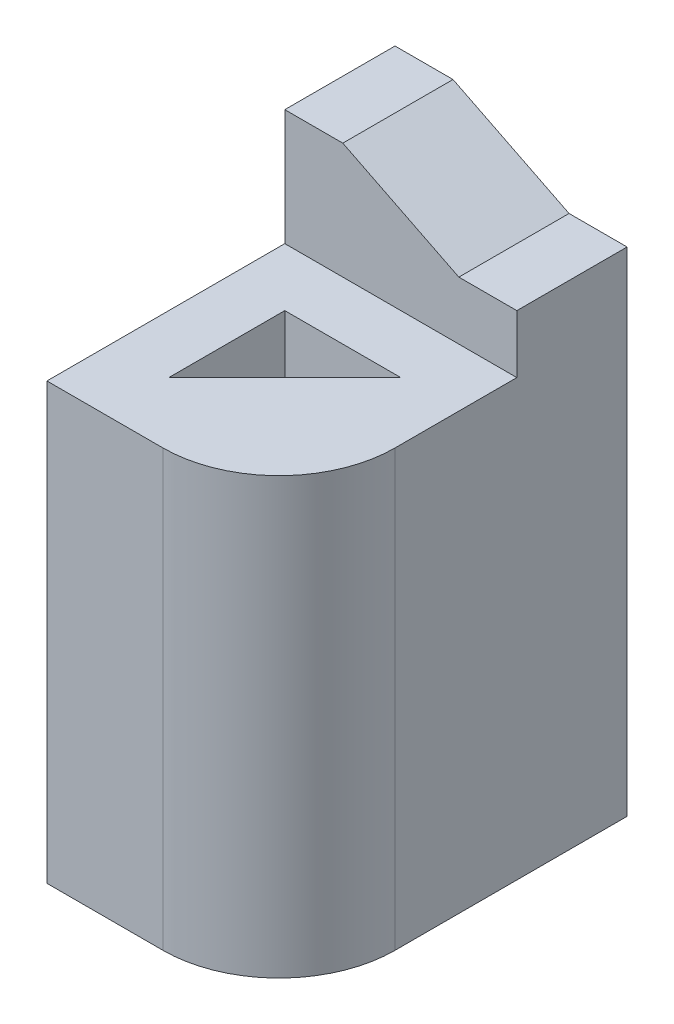
ISO-10303-21;
HEADER;
FILE_DESCRIPTION(('STEP AP214'),'2;1');
FILE_NAME('part.step','',(''),(''),'','','');
FILE_SCHEMA(('AUTOMOTIVE_DESIGN { 1 0 10303 214 1 1 1 1 }'));
ENDSEC;
DATA;
#1=APPLICATION_CONTEXT('core data for automotive mechanical design processes');
#2=APPLICATION_PROTOCOL_DEFINITION('international standard','automotive_design',2000,#1);
#3=PRODUCT_CONTEXT('',#1,'mechanical');
#4=PRODUCT('Part','Part','',(#3));
#5=PRODUCT_RELATED_PRODUCT_CATEGORY('part','',(#4));
#6=PRODUCT_DEFINITION_FORMATION('','',#4);
#7=PRODUCT_DEFINITION_CONTEXT('part definition',#1,'design');
#8=PRODUCT_DEFINITION('design','',#6,#7);
#9=PRODUCT_DEFINITION_SHAPE('','',#8);
#10=(LENGTH_UNIT() NAMED_UNIT(*) SI_UNIT(.MILLI.,.METRE.));
#11=(NAMED_UNIT(*) PLANE_ANGLE_UNIT() SI_UNIT($,.RADIAN.));
#12=(NAMED_UNIT(*) SI_UNIT($,.STERADIAN.) SOLID_ANGLE_UNIT());
#13=UNCERTAINTY_MEASURE_WITH_UNIT(LENGTH_MEASURE(1.E-05),#10,'distance_accuracy_value','');
#14=(GEOMETRIC_REPRESENTATION_CONTEXT(3) GLOBAL_UNCERTAINTY_ASSIGNED_CONTEXT((#13)) GLOBAL_UNIT_ASSIGNED_CONTEXT((#10,
#11,#12)) REPRESENTATION_CONTEXT('',''));
#15=CARTESIAN_POINT('',(0.,0.,0.));
#16=DIRECTION('',(0.,0.,1.));
#17=DIRECTION('',(1.,0.,0.));
#18=AXIS2_PLACEMENT_3D('',#15,#16,#17);
#19=CARTESIAN_POINT('',(0.,1905.,1524.));
#20=DIRECTION('',(0.,0.,-1.));
#21=DIRECTION('',(-1.,0.,0.));
#22=AXIS2_PLACEMENT_3D('',#19,#20,#21);
#23=PLANE('',#22);
#24=DIRECTION('',(1.,0.,0.));
#25=VECTOR('',#24,1.);
#26=CARTESIAN_POINT('',(0.,0.,1524.));
#27=LINE('',#26,#25);
#28=CARTESIAN_POINT('',(1.86636172190057E-13,0.,1524.));
#29=VERTEX_POINT('',#28);
#30=CARTESIAN_POINT('',(508.,0.,1524.));
#31=VERTEX_POINT('',#30);
#32=EDGE_CURVE('E150',#29,#31,#27,.T.);
#33=ORIENTED_EDGE('',*,*,#32,.T.);
#34=DIRECTION('',(0.,-1.,0.));
#35=VECTOR('',#34,1.);
#36=CARTESIAN_POINT('',(508.,1905.,1524.));
#37=LINE('',#36,#35);
#38=CARTESIAN_POINT('',(508.,1905.,1524.));
#39=VERTEX_POINT('',#38);
#40=EDGE_CURVE('E11',#39,#31,#37,.T.);
#41=ORIENTED_EDGE('',*,*,#40,.F.);
#42=DIRECTION('',(1.,0.,0.));
#43=VECTOR('',#42,1.);
#44=CARTESIAN_POINT('',(0.,1905.,1524.));
#45=LINE('',#44,#43);
#46=CARTESIAN_POINT('',(1.86636172190057E-13,1905.,1524.));
#47=VERTEX_POINT('',#46);
#48=EDGE_CURVE('E117',#47,#39,#45,.T.);
#49=ORIENTED_EDGE('',*,*,#48,.F.);
#50=DIRECTION('',(0.,-1.,0.));
#51=VECTOR('',#50,1.);
#52=CARTESIAN_POINT('',(1.86636172190057E-13,1905.,1524.));
#53=LINE('',#52,#51);
#54=EDGE_CURVE('E127',#47,#29,#53,.T.);
#55=ORIENTED_EDGE('',*,*,#54,.T.);
#56=EDGE_LOOP('',(#33,#41,#49,#55));
#57=FACE_BOUND('',#56,.T.);
#58=ADVANCED_FACE('F35',(#57),#23,.F.);
#59=CARTESIAN_POINT('',(508.,1905.,1016.));
#60=DIRECTION('',(0.,-1.,0.));
#61=DIRECTION('',(0.,0.,-1.));
#62=AXIS2_PLACEMENT_3D('',#59,#60,#61);
#63=CYLINDRICAL_SURFACE('',#62,508.);
#64=CARTESIAN_POINT('',(508.,0.,1016.));
#65=DIRECTION('',(0.,1.,0.));
#66=DIRECTION('',(0.,0.,1.));
#67=AXIS2_PLACEMENT_3D('',#64,#65,#66);
#68=CIRCLE('',#67,508.);
#69=CARTESIAN_POINT('',(1016.,0.,1016.));
#70=VERTEX_POINT('',#69);
#71=EDGE_CURVE('E123',#31,#70,#68,.T.);
#72=ORIENTED_EDGE('',*,*,#71,.T.);
#73=DIRECTION('',(0.,-1.,0.));
#74=VECTOR('',#73,1.);
#75=CARTESIAN_POINT('',(1016.,1905.,1016.));
#76=LINE('',#75,#74);
#77=CARTESIAN_POINT('',(1016.,1905.,1016.));
#78=VERTEX_POINT('',#77);
#79=EDGE_CURVE('E44',#78,#70,#76,.T.);
#80=ORIENTED_EDGE('',*,*,#79,.F.);
#81=CARTESIAN_POINT('',(508.,1905.,1016.));
#82=DIRECTION('',(0.,1.,0.));
#83=DIRECTION('',(0.,0.,1.));
#84=AXIS2_PLACEMENT_3D('',#81,#82,#83);
#85=CIRCLE('',#84,508.);
#86=EDGE_CURVE('E110',#39,#78,#85,.T.);
#87=ORIENTED_EDGE('',*,*,#86,.F.);
#88=ORIENTED_EDGE('',*,*,#40,.T.);
#89=EDGE_LOOP('',(#72,#80,#87,#88));
#90=FACE_BOUND('',#89,.T.);
#91=ADVANCED_FACE('F122',(#90),#63,.T.);
#92=CARTESIAN_POINT('',(1016.,1905.,0.));
#93=DIRECTION('',(-1.,0.,0.));
#94=DIRECTION('',(0.,0.,1.));
#95=AXIS2_PLACEMENT_3D('',#92,#93,#94);
#96=PLANE('',#95);
#97=DIRECTION('',(0.,-1.,0.));
#98=VECTOR('',#97,1.);
#99=CARTESIAN_POINT('',(1016.,2413.,0.));
#100=LINE('',#99,#98);
#101=CARTESIAN_POINT('',(1016.,2159.,1.11022302462516E-13));
#102=VERTEX_POINT('',#101);
#103=CARTESIAN_POINT('',(1016.,0.,0.));
#104=VERTEX_POINT('',#103);
#105=EDGE_CURVE('E343',#102,#104,#100,.T.);
#106=ORIENTED_EDGE('',*,*,#105,.F.);
#107=DIRECTION('',(0.,0.,1.));
#108=VECTOR('',#107,1.);
#109=CARTESIAN_POINT('',(1016.,2159.,1.11022302462516E-13));
#110=LINE('',#109,#108);
#111=CARTESIAN_POINT('',(1016.,2159.,482.6));
#112=VERTEX_POINT('',#111);
#113=EDGE_CURVE('E326',#102,#112,#110,.T.);
#114=ORIENTED_EDGE('',*,*,#113,.T.);
#115=DIRECTION('',(0.,-1.,0.));
#116=VECTOR('',#115,1.);
#117=CARTESIAN_POINT('',(1016.,2413.,482.6));
#118=LINE('',#117,#116);
#119=CARTESIAN_POINT('',(1016.,1905.,482.6));
#120=VERTEX_POINT('',#119);
#121=EDGE_CURVE('E134',#112,#120,#118,.T.);
#122=ORIENTED_EDGE('',*,*,#121,.T.);
#123=DIRECTION('',(0.,0.,-1.));
#124=VECTOR('',#123,1.);
#125=CARTESIAN_POINT('',(1016.,1905.,0.));
#126=LINE('',#125,#124);
#127=EDGE_CURVE('E114',#78,#120,#126,.T.);
#128=ORIENTED_EDGE('',*,*,#127,.F.);
#129=ORIENTED_EDGE('',*,*,#79,.T.);
#130=DIRECTION('',(0.,0.,-1.));
#131=VECTOR('',#130,1.);
#132=CARTESIAN_POINT('',(1016.,0.,0.));
#133=LINE('',#132,#131);
#134=EDGE_CURVE('E154',#70,#104,#133,.T.);
#135=ORIENTED_EDGE('',*,*,#134,.T.);
#136=EDGE_LOOP('',(#106,#114,#122,#128,#129,#135));
#137=FACE_BOUND('',#136,.T.);
#138=ADVANCED_FACE('F131',(#137),#96,.F.);
#139=CARTESIAN_POINT('',(749.3,1905.,749.3));
#140=DIRECTION('',(0.707106781186547,0.,0.707106781186547));
#141=DIRECTION('',(0.707106781186548,0.,-0.707106781186548));
#142=AXIS2_PLACEMENT_3D('',#139,#140,#141);
#143=PLANE('',#142);
#144=DIRECTION('',(-0.707106781186548,0.,0.707106781186548));
#145=VECTOR('',#144,1.);
#146=CARTESIAN_POINT('',(749.3,0.,749.3));
#147=LINE('',#146,#145);
#148=CARTESIAN_POINT('',(762.,0.,736.6));
#149=VERTEX_POINT('',#148);
#150=CARTESIAN_POINT('',(254.,0.,1244.6));
#151=VERTEX_POINT('',#150);
#152=EDGE_CURVE('E142',#149,#151,#147,.T.);
#153=ORIENTED_EDGE('',*,*,#152,.T.);
#154=DIRECTION('',(0.,-1.,0.));
#155=VECTOR('',#154,1.);
#156=CARTESIAN_POINT('',(254.,1905.,1244.6));
#157=LINE('',#156,#155);
#158=CARTESIAN_POINT('',(254.,1905.,1244.6));
#159=VERTEX_POINT('',#158);
#160=EDGE_CURVE('E39',#159,#151,#157,.T.);
#161=ORIENTED_EDGE('',*,*,#160,.F.);
#162=DIRECTION('',(-0.707106781186548,0.,0.707106781186548));
#163=VECTOR('',#162,1.);
#164=CARTESIAN_POINT('',(749.3,1905.,749.3));
#165=LINE('',#164,#163);
#166=CARTESIAN_POINT('',(762.,1905.,736.6));
#167=VERTEX_POINT('',#166);
#168=EDGE_CURVE('E157',#167,#159,#165,.T.);
#169=ORIENTED_EDGE('',*,*,#168,.F.);
#170=DIRECTION('',(0.,-1.,0.));
#171=VECTOR('',#170,1.);
#172=CARTESIAN_POINT('',(762.,1905.,736.6));
#173=LINE('',#172,#171);
#174=EDGE_CURVE('E141',#167,#149,#173,.T.);
#175=ORIENTED_EDGE('',*,*,#174,.T.);
#176=EDGE_LOOP('',(#153,#161,#169,#175));
#177=FACE_BOUND('',#176,.T.);
#178=ADVANCED_FACE('F37',(#177),#143,.F.);
#179=CARTESIAN_POINT('',(254.,1905.,0.));
#180=DIRECTION('',(-1.,0.,0.));
#181=DIRECTION('',(0.,0.,1.));
#182=AXIS2_PLACEMENT_3D('',#179,#180,#181);
#183=PLANE('',#182);
#184=DIRECTION('',(0.,0.,-1.));
#185=VECTOR('',#184,1.);
#186=CARTESIAN_POINT('',(254.,0.,0.));
#187=LINE('',#186,#185);
#188=CARTESIAN_POINT('',(254.,0.,736.6));
#189=VERTEX_POINT('',#188);
#190=EDGE_CURVE('E145',#151,#189,#187,.T.);
#191=ORIENTED_EDGE('',*,*,#190,.T.);
#192=DIRECTION('',(0.,-1.,0.));
#193=VECTOR('',#192,1.);
#194=CARTESIAN_POINT('',(254.,1905.,736.6));
#195=LINE('',#194,#193);
#196=CARTESIAN_POINT('',(254.,1905.,736.6));
#197=VERTEX_POINT('',#196);
#198=EDGE_CURVE('E160',#197,#189,#195,.T.);
#199=ORIENTED_EDGE('',*,*,#198,.F.);
#200=DIRECTION('',(0.,0.,-1.));
#201=VECTOR('',#200,1.);
#202=CARTESIAN_POINT('',(254.,1905.,0.));
#203=LINE('',#202,#201);
#204=EDGE_CURVE('E97',#159,#197,#203,.T.);
#205=ORIENTED_EDGE('',*,*,#204,.F.);
#206=ORIENTED_EDGE('',*,*,#160,.T.);
#207=EDGE_LOOP('',(#191,#199,#205,#206));
#208=FACE_BOUND('',#207,.T.);
#209=ADVANCED_FACE('F166',(#208),#183,.F.);
#210=CARTESIAN_POINT('',(0.,1905.,736.6));
#211=DIRECTION('',(0.,0.,-1.));
#212=DIRECTION('',(-1.,0.,0.));
#213=AXIS2_PLACEMENT_3D('',#210,#211,#212);
#214=PLANE('',#213);
#215=DIRECTION('',(1.,0.,0.));
#216=VECTOR('',#215,1.);
#217=CARTESIAN_POINT('',(0.,0.,736.6));
#218=LINE('',#217,#216);
#219=EDGE_CURVE('E148',#189,#149,#218,.T.);
#220=ORIENTED_EDGE('',*,*,#219,.T.);
#221=ORIENTED_EDGE('',*,*,#174,.F.);
#222=DIRECTION('',(1.,0.,0.));
#223=VECTOR('',#222,1.);
#224=CARTESIAN_POINT('',(0.,1905.,736.6));
#225=LINE('',#224,#223);
#226=EDGE_CURVE('E175',#197,#167,#225,.T.);
#227=ORIENTED_EDGE('',*,*,#226,.F.);
#228=ORIENTED_EDGE('',*,*,#198,.T.);
#229=EDGE_LOOP('',(#220,#221,#227,#228));
#230=FACE_BOUND('',#229,.T.);
#231=ADVANCED_FACE('F174',(#230),#214,.F.);
#232=CARTESIAN_POINT('',(0.,1905.,0.));
#233=DIRECTION('',(1.,0.,0.));
#234=DIRECTION('',(0.,0.,-1.));
#235=AXIS2_PLACEMENT_3D('',#232,#233,#234);
#236=PLANE('',#235);
#237=DIRECTION('',(0.,0.,1.));
#238=VECTOR('',#237,1.);
#239=CARTESIAN_POINT('',(0.,0.,0.));
#240=LINE('',#239,#238);
#241=CARTESIAN_POINT('',(0.,0.,0.));
#242=VERTEX_POINT('',#241);
#243=EDGE_CURVE('E88',#242,#29,#240,.T.);
#244=ORIENTED_EDGE('',*,*,#243,.T.);
#245=ORIENTED_EDGE('',*,*,#54,.F.);
#246=DIRECTION('',(0.,0.,1.));
#247=VECTOR('',#246,1.);
#248=CARTESIAN_POINT('',(0.,1905.,0.));
#249=LINE('',#248,#247);
#250=CARTESIAN_POINT('',(0.,1905.,482.6));
#251=VERTEX_POINT('',#250);
#252=EDGE_CURVE('E61',#251,#47,#249,.T.);
#253=ORIENTED_EDGE('',*,*,#252,.F.);
#254=DIRECTION('',(0.,-1.,0.));
#255=VECTOR('',#254,1.);
#256=CARTESIAN_POINT('',(0.,2413.,482.6));
#257=LINE('',#256,#255);
#258=CARTESIAN_POINT('',(0.,2413.,482.6));
#259=VERTEX_POINT('',#258);
#260=EDGE_CURVE('E146',#259,#251,#257,.T.);
#261=ORIENTED_EDGE('',*,*,#260,.F.);
#262=DIRECTION('',(0.,0.,1.));
#263=VECTOR('',#262,1.);
#264=CARTESIAN_POINT('',(0.,2413.,0.));
#265=LINE('',#264,#263);
#266=CARTESIAN_POINT('',(0.,2413.,0.));
#267=VERTEX_POINT('',#266);
#268=EDGE_CURVE('E331',#267,#259,#265,.T.);
#269=ORIENTED_EDGE('',*,*,#268,.F.);
#270=DIRECTION('',(0.,-1.,0.));
#271=VECTOR('',#270,1.);
#272=CARTESIAN_POINT('',(0.,2413.,0.));
#273=LINE('',#272,#271);
#274=EDGE_CURVE('E339',#267,#242,#273,.T.);
#275=ORIENTED_EDGE('',*,*,#274,.T.);
#276=EDGE_LOOP('',(#244,#245,#253,#261,#269,#275));
#277=FACE_BOUND('',#276,.T.);
#278=ADVANCED_FACE('F183',(#277),#236,.F.);
#279=CARTESIAN_POINT('',(0.,1905.,0.));
#280=DIRECTION('',(0.,1.,0.));
#281=DIRECTION('',(0.,0.,1.));
#282=AXIS2_PLACEMENT_3D('',#279,#280,#281);
#283=PLANE('',#282);
#284=ORIENTED_EDGE('',*,*,#168,.T.);
#285=ORIENTED_EDGE('',*,*,#204,.T.);
#286=ORIENTED_EDGE('',*,*,#226,.T.);
#287=EDGE_LOOP('',(#284,#285,#286));
#288=FACE_BOUND('',#287,.T.);
#289=ORIENTED_EDGE('',*,*,#48,.T.);
#290=ORIENTED_EDGE('',*,*,#86,.T.);
#291=ORIENTED_EDGE('',*,*,#127,.T.);
#292=DIRECTION('',(1.,0.,0.));
#293=VECTOR('',#292,1.);
#294=CARTESIAN_POINT('',(0.,1905.,482.6));
#295=LINE('',#294,#293);
#296=EDGE_CURVE('E135',#251,#120,#295,.T.);
#297=ORIENTED_EDGE('',*,*,#296,.F.);
#298=ORIENTED_EDGE('',*,*,#252,.T.);
#299=EDGE_LOOP('',(#289,#290,#291,#297,#298));
#300=FACE_BOUND('',#299,.T.);
#301=ADVANCED_FACE('F112',(#288,#300),#283,.T.);
#302=CARTESIAN_POINT('',(0.,0.,0.));
#303=DIRECTION('',(0.,1.,0.));
#304=DIRECTION('',(0.,0.,1.));
#305=AXIS2_PLACEMENT_3D('',#302,#303,#304);
#306=PLANE('',#305);
#307=ORIENTED_EDGE('',*,*,#152,.F.);
#308=ORIENTED_EDGE('',*,*,#219,.F.);
#309=ORIENTED_EDGE('',*,*,#190,.F.);
#310=EDGE_LOOP('',(#307,#308,#309));
#311=FACE_BOUND('',#310,.T.);
#312=ORIENTED_EDGE('',*,*,#32,.F.);
#313=ORIENTED_EDGE('',*,*,#243,.F.);
#314=DIRECTION('',(-1.,0.,0.));
#315=VECTOR('',#314,1.);
#316=CARTESIAN_POINT('',(0.,0.,0.));
#317=LINE('',#316,#315);
#318=EDGE_CURVE('E328',#104,#242,#317,.T.);
#319=ORIENTED_EDGE('',*,*,#318,.F.);
#320=ORIENTED_EDGE('',*,*,#134,.F.);
#321=ORIENTED_EDGE('',*,*,#71,.F.);
#322=EDGE_LOOP('',(#312,#313,#319,#320,#321));
#323=FACE_BOUND('',#322,.T.);
#324=ADVANCED_FACE('F172',(#311,#323),#306,.F.);
#325=CARTESIAN_POINT('',(0.,2413.,482.6));
#326=DIRECTION('',(0.,0.,-1.));
#327=DIRECTION('',(-1.,0.,0.));
#328=AXIS2_PLACEMENT_3D('',#325,#326,#327);
#329=PLANE('',#328);
#330=ORIENTED_EDGE('',*,*,#121,.F.);
#331=DIRECTION('',(1.,0.,0.));
#332=VECTOR('',#331,1.);
#333=CARTESIAN_POINT('',(762.,2159.,482.6));
#334=LINE('',#333,#332);
#335=CARTESIAN_POINT('',(762.,2159.,482.6));
#336=VERTEX_POINT('',#335);
#337=EDGE_CURVE('E317',#336,#112,#334,.T.);
#338=ORIENTED_EDGE('',*,*,#337,.F.);
#339=DIRECTION('',(0.894427190999916,-0.447213595499958,0.));
#340=VECTOR('',#339,1.);
#341=CARTESIAN_POINT('',(254.,2413.,482.6));
#342=LINE('',#341,#340);
#343=CARTESIAN_POINT('',(254.,2413.,482.6));
#344=VERTEX_POINT('',#343);
#345=EDGE_CURVE('E305',#344,#336,#342,.T.);
#346=ORIENTED_EDGE('',*,*,#345,.F.);
#347=DIRECTION('',(1.,0.,0.));
#348=VECTOR('',#347,1.);
#349=CARTESIAN_POINT('',(0.,2413.,482.6));
#350=LINE('',#349,#348);
#351=EDGE_CURVE('E334',#259,#344,#350,.T.);
#352=ORIENTED_EDGE('',*,*,#351,.F.);
#353=ORIENTED_EDGE('',*,*,#260,.T.);
#354=ORIENTED_EDGE('',*,*,#296,.T.);
#355=EDGE_LOOP('',(#330,#338,#346,#352,#353,#354));
#356=FACE_BOUND('',#355,.T.);
#357=ADVANCED_FACE('F189',(#356),#329,.F.);
#358=CARTESIAN_POINT('',(0.,2413.,0.));
#359=DIRECTION('',(0.,0.,1.));
#360=DIRECTION('',(1.,0.,0.));
#361=AXIS2_PLACEMENT_3D('',#358,#359,#360);
#362=PLANE('',#361);
#363=DIRECTION('',(0.894427190999916,-0.447213595499958,0.));
#364=VECTOR('',#363,1.);
#365=CARTESIAN_POINT('',(254.,2413.,1.11022302462516E-13));
#366=LINE('',#365,#364);
#367=CARTESIAN_POINT('',(254.,2413.,0.));
#368=VERTEX_POINT('',#367);
#369=CARTESIAN_POINT('',(762.,2159.,1.11022302462516E-13));
#370=VERTEX_POINT('',#369);
#371=EDGE_CURVE('E52',#368,#370,#366,.T.);
#372=ORIENTED_EDGE('',*,*,#371,.T.);
#373=DIRECTION('',(1.,0.,0.));
#374=VECTOR('',#373,1.);
#375=CARTESIAN_POINT('',(762.,2159.,1.11022302462516E-13));
#376=LINE('',#375,#374);
#377=EDGE_CURVE('E322',#370,#102,#376,.T.);
#378=ORIENTED_EDGE('',*,*,#377,.T.);
#379=ORIENTED_EDGE('',*,*,#105,.T.);
#380=ORIENTED_EDGE('',*,*,#318,.T.);
#381=ORIENTED_EDGE('',*,*,#274,.F.);
#382=DIRECTION('',(-1.,0.,0.));
#383=VECTOR('',#382,1.);
#384=CARTESIAN_POINT('',(0.,2413.,0.));
#385=LINE('',#384,#383);
#386=EDGE_CURVE('E336',#368,#267,#385,.T.);
#387=ORIENTED_EDGE('',*,*,#386,.F.);
#388=EDGE_LOOP('',(#372,#378,#379,#380,#381,#387));
#389=FACE_BOUND('',#388,.T.);
#390=ADVANCED_FACE('F260',(#389),#362,.F.);
#391=CARTESIAN_POINT('',(0.,2413.,0.));
#392=DIRECTION('',(0.,1.,0.));
#393=DIRECTION('',(0.,0.,1.));
#394=AXIS2_PLACEMENT_3D('',#391,#392,#393);
#395=PLANE('',#394);
#396=DIRECTION('',(0.,0.,1.));
#397=VECTOR('',#396,1.);
#398=CARTESIAN_POINT('',(254.,2413.,1.11022302462516E-13));
#399=LINE('',#398,#397);
#400=EDGE_CURVE('E312',#368,#344,#399,.T.);
#401=ORIENTED_EDGE('',*,*,#400,.F.);
#402=ORIENTED_EDGE('',*,*,#386,.T.);
#403=ORIENTED_EDGE('',*,*,#268,.T.);
#404=ORIENTED_EDGE('',*,*,#351,.T.);
#405=EDGE_LOOP('',(#401,#402,#403,#404));
#406=FACE_BOUND('',#405,.T.);
#407=ADVANCED_FACE('F266',(#406),#395,.T.);
#408=CARTESIAN_POINT('',(762.,2159.,1.11022302462516E-13));
#409=DIRECTION('',(0.,-1.,0.));
#410=DIRECTION('',(0.,0.,-1.));
#411=AXIS2_PLACEMENT_3D('',#408,#409,#410);
#412=PLANE('',#411);
#413=ORIENTED_EDGE('',*,*,#337,.T.);
#414=ORIENTED_EDGE('',*,*,#113,.F.);
#415=ORIENTED_EDGE('',*,*,#377,.F.);
#416=DIRECTION('',(0.,0.,1.));
#417=VECTOR('',#416,1.);
#418=CARTESIAN_POINT('',(762.,2159.,1.11022302462516E-13));
#419=LINE('',#418,#417);
#420=EDGE_CURVE('E309',#370,#336,#419,.T.);
#421=ORIENTED_EDGE('',*,*,#420,.T.);
#422=EDGE_LOOP('',(#413,#414,#415,#421));
#423=FACE_BOUND('',#422,.T.);
#424=ADVANCED_FACE('F274',(#423),#412,.F.);
#425=CARTESIAN_POINT('',(254.,2413.,1.11022302462516E-13));
#426=DIRECTION('',(-0.447213595499958,-0.894427190999916,0.));
#427=DIRECTION('',(0.894427190999916,-0.447213595499958,0.));
#428=AXIS2_PLACEMENT_3D('',#425,#426,#427);
#429=PLANE('',#428);
#430=ORIENTED_EDGE('',*,*,#345,.T.);
#431=ORIENTED_EDGE('',*,*,#420,.F.);
#432=ORIENTED_EDGE('',*,*,#371,.F.);
#433=ORIENTED_EDGE('',*,*,#400,.T.);
#434=EDGE_LOOP('',(#430,#431,#432,#433));
#435=FACE_BOUND('',#434,.T.);
#436=ADVANCED_FACE('F282',(#435),#429,.F.);
#437=CLOSED_SHELL('',(#58,#91,#138,#178,#209,#231,#278,#301,#324,#357,#390,#407,#424,#436));
#438=MANIFOLD_SOLID_BREP('B2',#437);
#439=ADVANCED_BREP_SHAPE_REPRESENTATION('',(#18,#438),#14);
#440=SHAPE_DEFINITION_REPRESENTATION(#9,#439);
ENDSEC;
END-ISO-10303-21;
